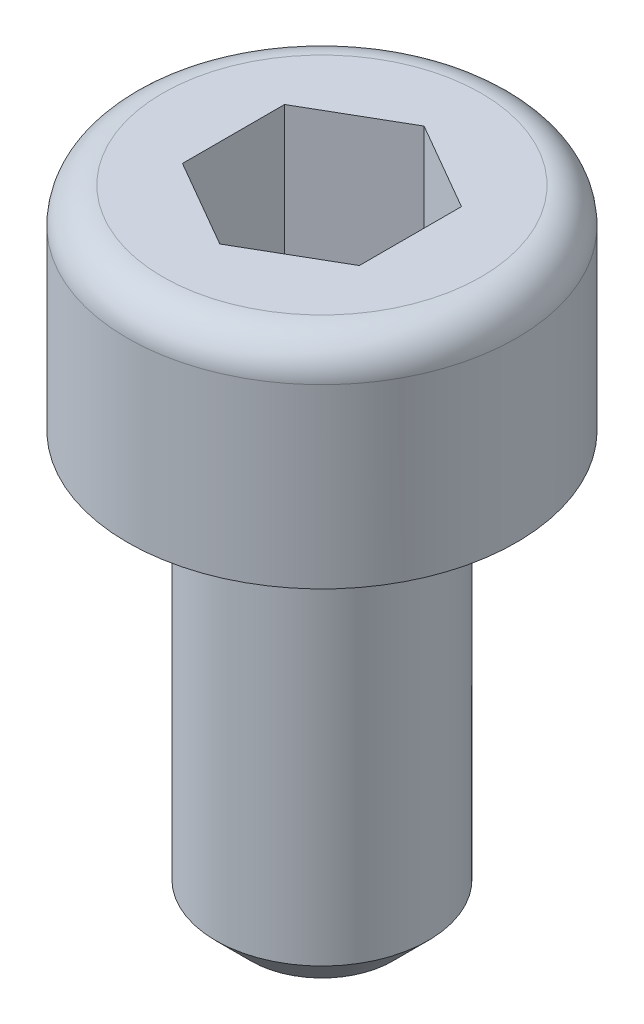
ISO-10303-21;
HEADER;
FILE_DESCRIPTION(('STEP AP214'),'2;1');
FILE_NAME('part.step','',(''),(''),'','','');
FILE_SCHEMA(('AUTOMOTIVE_DESIGN { 1 0 10303 214 1 1 1 1 }'));
ENDSEC;
DATA;
#1=APPLICATION_CONTEXT('core data for automotive mechanical design processes');
#2=APPLICATION_PROTOCOL_DEFINITION('international standard','automotive_design',2000,#1);
#3=PRODUCT_CONTEXT('',#1,'mechanical');
#4=PRODUCT('Part','Part','',(#3));
#5=PRODUCT_RELATED_PRODUCT_CATEGORY('part','',(#4));
#6=PRODUCT_DEFINITION_FORMATION('','',#4);
#7=PRODUCT_DEFINITION_CONTEXT('part definition',#1,'design');
#8=PRODUCT_DEFINITION('design','',#6,#7);
#9=PRODUCT_DEFINITION_SHAPE('','',#8);
#10=(LENGTH_UNIT() NAMED_UNIT(*) SI_UNIT(.MILLI.,.METRE.));
#11=(NAMED_UNIT(*) PLANE_ANGLE_UNIT() SI_UNIT($,.RADIAN.));
#12=(NAMED_UNIT(*) SI_UNIT($,.STERADIAN.) SOLID_ANGLE_UNIT());
#13=UNCERTAINTY_MEASURE_WITH_UNIT(LENGTH_MEASURE(1.E-05),#10,'distance_accuracy_value','');
#14=(GEOMETRIC_REPRESENTATION_CONTEXT(3) GLOBAL_UNCERTAINTY_ASSIGNED_CONTEXT((#13)) GLOBAL_UNIT_ASSIGNED_CONTEXT((#10,
#11,#12)) REPRESENTATION_CONTEXT('',''));
#15=CARTESIAN_POINT('',(0.,0.,0.));
#16=DIRECTION('',(0.,0.,1.));
#17=DIRECTION('',(1.,0.,0.));
#18=AXIS2_PLACEMENT_3D('',#15,#16,#17);
#19=CARTESIAN_POINT('',(0.,0.,0.));
#20=DIRECTION('',(0.,-1.,0.));
#21=DIRECTION('',(0.,0.,-1.));
#22=AXIS2_PLACEMENT_3D('',#19,#20,#21);
#23=PLANE('',#22);
#24=CARTESIAN_POINT('',(0.,0.,0.));
#25=DIRECTION('',(0.,-1.,0.));
#26=DIRECTION('',(0.,0.,-1.));
#27=AXIS2_PLACEMENT_3D('',#24,#25,#26);
#28=CIRCLE('',#27,2.25);
#29=CARTESIAN_POINT('',(0.,0.,-2.25));
#30=VERTEX_POINT('',#29);
#31=EDGE_CURVE('E42',#30,#30,#28,.F.);
#32=ORIENTED_EDGE('',*,*,#31,.T.);
#33=EDGE_LOOP('',(#32));
#34=FACE_BOUND('',#33,.T.);
#35=DIRECTION('',(-0.866025403784439,0.,-0.5));
#36=VECTOR('',#35,1.);
#37=CARTESIAN_POINT('',(1.25,0.,-0.721687836487032));
#38=LINE('',#37,#36);
#39=CARTESIAN_POINT('',(1.25,0.,-0.721687836487032));
#40=VERTEX_POINT('',#39);
#41=CARTESIAN_POINT('',(0.,0.,-1.44337567297406));
#42=VERTEX_POINT('',#41);
#43=EDGE_CURVE('E123',#40,#42,#38,.T.);
#44=ORIENTED_EDGE('',*,*,#43,.F.);
#45=DIRECTION('',(0.,0.,-1.));
#46=VECTOR('',#45,1.);
#47=CARTESIAN_POINT('',(1.25,0.,0.721687836487033));
#48=LINE('',#47,#46);
#49=CARTESIAN_POINT('',(1.25,0.,0.721687836487033));
#50=VERTEX_POINT('',#49);
#51=EDGE_CURVE('E49',#50,#40,#48,.T.);
#52=ORIENTED_EDGE('',*,*,#51,.F.);
#53=DIRECTION('',(0.866025403784439,0.,-0.5));
#54=VECTOR('',#53,1.);
#55=CARTESIAN_POINT('',(0.,0.,1.44337567297406));
#56=LINE('',#55,#54);
#57=CARTESIAN_POINT('',(0.,0.,1.44337567297406));
#58=VERTEX_POINT('',#57);
#59=EDGE_CURVE('E132',#58,#50,#56,.T.);
#60=ORIENTED_EDGE('',*,*,#59,.F.);
#61=DIRECTION('',(0.866025403784439,0.,0.5));
#62=VECTOR('',#61,1.);
#63=CARTESIAN_POINT('',(-1.25,0.,0.721687836487031));
#64=LINE('',#63,#62);
#65=CARTESIAN_POINT('',(-1.25,0.,0.721687836487031));
#66=VERTEX_POINT('',#65);
#67=EDGE_CURVE('E130',#66,#58,#64,.T.);
#68=ORIENTED_EDGE('',*,*,#67,.F.);
#69=DIRECTION('',(0.,0.,1.));
#70=VECTOR('',#69,1.);
#71=CARTESIAN_POINT('',(-1.25,0.,-0.721687836487033));
#72=LINE('',#71,#70);
#73=CARTESIAN_POINT('',(-1.25,0.,-0.721687836487033));
#74=VERTEX_POINT('',#73);
#75=EDGE_CURVE('E97',#74,#66,#72,.T.);
#76=ORIENTED_EDGE('',*,*,#75,.F.);
#77=DIRECTION('',(-0.866025403784439,0.,0.5));
#78=VECTOR('',#77,1.);
#79=CARTESIAN_POINT('',(0.,0.,-1.44337567297406));
#80=LINE('',#79,#78);
#81=EDGE_CURVE('E126',#42,#74,#80,.T.);
#82=ORIENTED_EDGE('',*,*,#81,.F.);
#83=EDGE_LOOP('',(#44,#52,#60,#68,#76,#82));
#84=FACE_BOUND('',#83,.T.);
#85=ADVANCED_FACE('F34',(#34,#84),#23,.F.);
#86=CARTESIAN_POINT('',(0.,0.,0.));
#87=DIRECTION('',(0.,1.,0.));
#88=DIRECTION('',(0.,0.,1.));
#89=AXIS2_PLACEMENT_3D('',#86,#87,#88);
#90=CYLINDRICAL_SURFACE('',#89,2.75);
#91=CARTESIAN_POINT('',(0.,-0.5,0.));
#92=DIRECTION('',(0.,-1.,0.));
#93=DIRECTION('',(0.,0.,-1.));
#94=AXIS2_PLACEMENT_3D('',#91,#92,#93);
#95=CIRCLE('',#94,2.75);
#96=CARTESIAN_POINT('',(0.,-0.5,-2.75));
#97=VERTEX_POINT('',#96);
#98=EDGE_CURVE('E11',#97,#97,#95,.T.);
#99=ORIENTED_EDGE('',*,*,#98,.T.);
#100=EDGE_LOOP('',(#99));
#101=FACE_BOUND('',#100,.T.);
#102=CARTESIAN_POINT('',(0.,-3.,0.));
#103=DIRECTION('',(0.,1.,0.));
#104=DIRECTION('',(0.,0.,1.));
#105=AXIS2_PLACEMENT_3D('',#102,#103,#104);
#106=CIRCLE('',#105,2.75);
#107=CARTESIAN_POINT('',(0.,-3.,2.75));
#108=VERTEX_POINT('',#107);
#109=EDGE_CURVE('E144',#108,#108,#106,.T.);
#110=ORIENTED_EDGE('',*,*,#109,.T.);
#111=EDGE_LOOP('',(#110));
#112=FACE_BOUND('',#111,.T.);
#113=ADVANCED_FACE('F166',(#101,#112),#90,.T.);
#114=CARTESIAN_POINT('',(2.75,-3.,0.));
#115=DIRECTION('',(0.,1.,0.));
#116=DIRECTION('',(0.,0.,1.));
#117=AXIS2_PLACEMENT_3D('',#114,#115,#116);
#118=PLANE('',#117);
#119=ORIENTED_EDGE('',*,*,#109,.F.);
#120=EDGE_LOOP('',(#119));
#121=FACE_BOUND('',#120,.T.);
#122=CARTESIAN_POINT('',(0.,-3.,0.));
#123=DIRECTION('',(0.,1.,0.));
#124=DIRECTION('',(0.,0.,1.));
#125=AXIS2_PLACEMENT_3D('',#122,#123,#124);
#126=CIRCLE('',#125,1.5);
#127=CARTESIAN_POINT('',(0.,-3.,1.5));
#128=VERTEX_POINT('',#127);
#129=EDGE_CURVE('E136',#128,#128,#126,.T.);
#130=ORIENTED_EDGE('',*,*,#129,.T.);
#131=EDGE_LOOP('',(#130));
#132=FACE_BOUND('',#131,.T.);
#133=ADVANCED_FACE('F171',(#121,#132),#118,.F.);
#134=CARTESIAN_POINT('',(0.,0.,0.));
#135=DIRECTION('',(0.,1.,0.));
#136=DIRECTION('',(0.,0.,1.));
#137=AXIS2_PLACEMENT_3D('',#134,#135,#136);
#138=CYLINDRICAL_SURFACE('',#137,1.5);
#139=CARTESIAN_POINT('',(0.,-8.5,0.));
#140=DIRECTION('',(0.,1.,0.));
#141=DIRECTION('',(0.,0.,1.));
#142=AXIS2_PLACEMENT_3D('',#139,#140,#141);
#143=CIRCLE('',#142,1.5);
#144=CARTESIAN_POINT('',(0.,-8.5,1.5));
#145=VERTEX_POINT('',#144);
#146=EDGE_CURVE('E147',#145,#145,#143,.T.);
#147=ORIENTED_EDGE('',*,*,#146,.T.);
#148=EDGE_LOOP('',(#147));
#149=FACE_BOUND('',#148,.T.);
#150=ORIENTED_EDGE('',*,*,#129,.F.);
#151=EDGE_LOOP('',(#150));
#152=FACE_BOUND('',#151,.T.);
#153=ADVANCED_FACE('F177',(#149,#152),#138,.T.);
#154=CARTESIAN_POINT('',(1.5,-9.,0.));
#155=DIRECTION('',(0.,1.,0.));
#156=DIRECTION('',(0.,0.,1.));
#157=AXIS2_PLACEMENT_3D('',#154,#155,#156);
#158=PLANE('',#157);
#159=CARTESIAN_POINT('',(0.,-9.,0.));
#160=DIRECTION('',(0.,1.,0.));
#161=DIRECTION('',(0.,0.,1.));
#162=AXIS2_PLACEMENT_3D('',#159,#160,#161);
#163=CIRCLE('',#162,0.999999999999996);
#164=CARTESIAN_POINT('',(0.,-9.,0.999999999999996));
#165=VERTEX_POINT('',#164);
#166=EDGE_CURVE('E150',#165,#165,#163,.F.);
#167=ORIENTED_EDGE('',*,*,#166,.T.);
#168=EDGE_LOOP('',(#167));
#169=FACE_BOUND('',#168,.T.);
#170=ADVANCED_FACE('F181',(#169),#158,.F.);
#171=CARTESIAN_POINT('',(1.25,-2.,0.721687836487033));
#172=DIRECTION('',(1.,0.,0.));
#173=DIRECTION('',(0.,0.,-1.));
#174=AXIS2_PLACEMENT_3D('',#171,#172,#173);
#175=PLANE('',#174);
#176=ORIENTED_EDGE('',*,*,#51,.T.);
#177=DIRECTION('',(0.,1.,0.));
#178=VECTOR('',#177,1.);
#179=CARTESIAN_POINT('',(1.25,-2.,-0.721687836487032));
#180=LINE('',#179,#178);
#181=CARTESIAN_POINT('',(1.25,-2.,-0.721687836487032));
#182=VERTEX_POINT('',#181);
#183=EDGE_CURVE('E79',#182,#40,#180,.T.);
#184=ORIENTED_EDGE('',*,*,#183,.F.);
#185=DIRECTION('',(0.,0.,-1.));
#186=VECTOR('',#185,1.);
#187=CARTESIAN_POINT('',(1.25,-2.,0.721687836487033));
#188=LINE('',#187,#186);
#189=CARTESIAN_POINT('',(1.25,-2.,0.721687836487033));
#190=VERTEX_POINT('',#189);
#191=EDGE_CURVE('E134',#190,#182,#188,.T.);
#192=ORIENTED_EDGE('',*,*,#191,.F.);
#193=DIRECTION('',(0.,1.,0.));
#194=VECTOR('',#193,1.);
#195=CARTESIAN_POINT('',(1.25,-2.,0.721687836487033));
#196=LINE('',#195,#194);
#197=EDGE_CURVE('E57',#190,#50,#196,.T.);
#198=ORIENTED_EDGE('',*,*,#197,.T.);
#199=EDGE_LOOP('',(#176,#184,#192,#198));
#200=FACE_BOUND('',#199,.T.);
#201=ADVANCED_FACE('F185',(#200),#175,.F.);
#202=CARTESIAN_POINT('',(0.,-2.,1.44337567297406));
#203=DIRECTION('',(0.5,0.,0.866025403784439));
#204=DIRECTION('',(0.866025403784439,0.,-0.5));
#205=AXIS2_PLACEMENT_3D('',#202,#203,#204);
#206=PLANE('',#205);
#207=ORIENTED_EDGE('',*,*,#59,.T.);
#208=ORIENTED_EDGE('',*,*,#197,.F.);
#209=DIRECTION('',(0.866025403784439,0.,-0.5));
#210=VECTOR('',#209,1.);
#211=CARTESIAN_POINT('',(0.,-2.,1.44337567297406));
#212=LINE('',#211,#210);
#213=CARTESIAN_POINT('',(0.,-2.,1.44337567297406));
#214=VERTEX_POINT('',#213);
#215=EDGE_CURVE('E109',#214,#190,#212,.T.);
#216=ORIENTED_EDGE('',*,*,#215,.F.);
#217=DIRECTION('',(0.,1.,0.));
#218=VECTOR('',#217,1.);
#219=CARTESIAN_POINT('',(0.,-2.,1.44337567297406));
#220=LINE('',#219,#218);
#221=EDGE_CURVE('E101',#214,#58,#220,.T.);
#222=ORIENTED_EDGE('',*,*,#221,.T.);
#223=EDGE_LOOP('',(#207,#208,#216,#222));
#224=FACE_BOUND('',#223,.T.);
#225=ADVANCED_FACE('F189',(#224),#206,.F.);
#226=CARTESIAN_POINT('',(-1.25,-2.,0.721687836487031));
#227=DIRECTION('',(-0.5,0.,0.866025403784439));
#228=DIRECTION('',(0.866025403784439,0.,0.5));
#229=AXIS2_PLACEMENT_3D('',#226,#227,#228);
#230=PLANE('',#229);
#231=ORIENTED_EDGE('',*,*,#67,.T.);
#232=ORIENTED_EDGE('',*,*,#221,.F.);
#233=DIRECTION('',(0.866025403784439,0.,0.5));
#234=VECTOR('',#233,1.);
#235=CARTESIAN_POINT('',(-1.25,-2.,0.721687836487031));
#236=LINE('',#235,#234);
#237=CARTESIAN_POINT('',(-1.25,-2.,0.721687836487031));
#238=VERTEX_POINT('',#237);
#239=EDGE_CURVE('E105',#238,#214,#236,.T.);
#240=ORIENTED_EDGE('',*,*,#239,.F.);
#241=DIRECTION('',(0.,1.,0.));
#242=VECTOR('',#241,1.);
#243=CARTESIAN_POINT('',(-1.25,-2.,0.721687836487031));
#244=LINE('',#243,#242);
#245=EDGE_CURVE('E90',#238,#66,#244,.T.);
#246=ORIENTED_EDGE('',*,*,#245,.T.);
#247=EDGE_LOOP('',(#231,#232,#240,#246));
#248=FACE_BOUND('',#247,.T.);
#249=ADVANCED_FACE('F106',(#248),#230,.F.);
#250=CARTESIAN_POINT('',(-1.25,-2.,-0.721687836487033));
#251=DIRECTION('',(-1.,0.,0.));
#252=DIRECTION('',(0.,0.,1.));
#253=AXIS2_PLACEMENT_3D('',#250,#251,#252);
#254=PLANE('',#253);
#255=ORIENTED_EDGE('',*,*,#75,.T.);
#256=ORIENTED_EDGE('',*,*,#245,.F.);
#257=DIRECTION('',(0.,0.,1.));
#258=VECTOR('',#257,1.);
#259=CARTESIAN_POINT('',(-1.25,-2.,-0.721687836487033));
#260=LINE('',#259,#258);
#261=CARTESIAN_POINT('',(-1.25,-2.,-0.721687836487033));
#262=VERTEX_POINT('',#261);
#263=EDGE_CURVE('E94',#262,#238,#260,.T.);
#264=ORIENTED_EDGE('',*,*,#263,.F.);
#265=DIRECTION('',(0.,1.,0.));
#266=VECTOR('',#265,1.);
#267=CARTESIAN_POINT('',(-1.25,-2.,-0.721687836487033));
#268=LINE('',#267,#266);
#269=EDGE_CURVE('E102',#262,#74,#268,.T.);
#270=ORIENTED_EDGE('',*,*,#269,.T.);
#271=EDGE_LOOP('',(#255,#256,#264,#270));
#272=FACE_BOUND('',#271,.T.);
#273=ADVANCED_FACE('F92',(#272),#254,.F.);
#274=CARTESIAN_POINT('',(0.,-2.,-1.44337567297406));
#275=DIRECTION('',(-0.5,0.,-0.866025403784439));
#276=DIRECTION('',(-0.866025403784439,0.,0.5));
#277=AXIS2_PLACEMENT_3D('',#274,#275,#276);
#278=PLANE('',#277);
#279=ORIENTED_EDGE('',*,*,#81,.T.);
#280=ORIENTED_EDGE('',*,*,#269,.F.);
#281=DIRECTION('',(-0.866025403784439,0.,0.5));
#282=VECTOR('',#281,1.);
#283=CARTESIAN_POINT('',(0.,-2.,-1.44337567297406));
#284=LINE('',#283,#282);
#285=CARTESIAN_POINT('',(0.,-2.,-1.44337567297406));
#286=VERTEX_POINT('',#285);
#287=EDGE_CURVE('E115',#286,#262,#284,.T.);
#288=ORIENTED_EDGE('',*,*,#287,.F.);
#289=DIRECTION('',(0.,1.,0.));
#290=VECTOR('',#289,1.);
#291=CARTESIAN_POINT('',(0.,-2.,-1.44337567297406));
#292=LINE('',#291,#290);
#293=EDGE_CURVE('E139',#286,#42,#292,.T.);
#294=ORIENTED_EDGE('',*,*,#293,.T.);
#295=EDGE_LOOP('',(#279,#280,#288,#294));
#296=FACE_BOUND('',#295,.T.);
#297=ADVANCED_FACE('F193',(#296),#278,.F.);
#298=CARTESIAN_POINT('',(1.25,-2.,-0.721687836487032));
#299=DIRECTION('',(0.5,0.,-0.866025403784439));
#300=DIRECTION('',(-0.866025403784439,0.,-0.5));
#301=AXIS2_PLACEMENT_3D('',#298,#299,#300);
#302=PLANE('',#301);
#303=ORIENTED_EDGE('',*,*,#43,.T.);
#304=ORIENTED_EDGE('',*,*,#293,.F.);
#305=DIRECTION('',(-0.866025403784439,0.,-0.5));
#306=VECTOR('',#305,1.);
#307=CARTESIAN_POINT('',(1.25,-2.,-0.721687836487032));
#308=LINE('',#307,#306);
#309=EDGE_CURVE('E117',#182,#286,#308,.T.);
#310=ORIENTED_EDGE('',*,*,#309,.F.);
#311=ORIENTED_EDGE('',*,*,#183,.T.);
#312=EDGE_LOOP('',(#303,#304,#310,#311));
#313=FACE_BOUND('',#312,.T.);
#314=ADVANCED_FACE('F190',(#313),#302,.F.);
#315=CARTESIAN_POINT('',(1.25,-2.,-0.721687836487032));
#316=DIRECTION('',(0.,1.,0.));
#317=DIRECTION('',(0.,0.,1.));
#318=AXIS2_PLACEMENT_3D('',#315,#316,#317);
#319=PLANE('',#318);
#320=ORIENTED_EDGE('',*,*,#191,.T.);
#321=ORIENTED_EDGE('',*,*,#309,.T.);
#322=ORIENTED_EDGE('',*,*,#287,.T.);
#323=ORIENTED_EDGE('',*,*,#263,.T.);
#324=ORIENTED_EDGE('',*,*,#239,.T.);
#325=ORIENTED_EDGE('',*,*,#215,.T.);
#326=EDGE_LOOP('',(#320,#321,#322,#323,#324,#325));
#327=FACE_BOUND('',#326,.T.);
#328=ADVANCED_FACE('F112',(#327),#319,.T.);
#329=CARTESIAN_POINT('',(0.,-8.5,0.));
#330=DIRECTION('',(0.,1.,0.));
#331=DIRECTION('',(0.,0.,1.));
#332=AXIS2_PLACEMENT_3D('',#329,#330,#331);
#333=CONICAL_SURFACE('',#332,1.5,0.785398163397449);
#334=ORIENTED_EDGE('',*,*,#166,.F.);
#335=EDGE_LOOP('',(#334));
#336=FACE_BOUND('',#335,.T.);
#337=ORIENTED_EDGE('',*,*,#146,.F.);
#338=EDGE_LOOP('',(#337));
#339=FACE_BOUND('',#338,.T.);
#340=ADVANCED_FACE('F158',(#336,#339),#333,.T.);
#341=CARTESIAN_POINT('',(0.,-0.5,0.));
#342=DIRECTION('',(0.,-1.,0.));
#343=DIRECTION('',(0.,0.,-1.));
#344=AXIS2_PLACEMENT_3D('',#341,#342,#343);
#345=TOROIDAL_SURFACE('',#344,2.25,0.5);
#346=ORIENTED_EDGE('',*,*,#98,.F.);
#347=EDGE_LOOP('',(#346));
#348=FACE_BOUND('',#347,.T.);
#349=ORIENTED_EDGE('',*,*,#31,.F.);
#350=EDGE_LOOP('',(#349));
#351=FACE_BOUND('',#350,.T.);
#352=ADVANCED_FACE('F36',(#348,#351),#345,.T.);
#353=CLOSED_SHELL('',(#85,#113,#133,#153,#170,#201,#225,#249,#273,#297,#314,#328,#340,#352));
#354=MANIFOLD_SOLID_BREP('B2',#353);
#355=ADVANCED_BREP_SHAPE_REPRESENTATION('',(#18,#354),#14);
#356=SHAPE_DEFINITION_REPRESENTATION(#9,#355);
ENDSEC;
END-ISO-10303-21;
